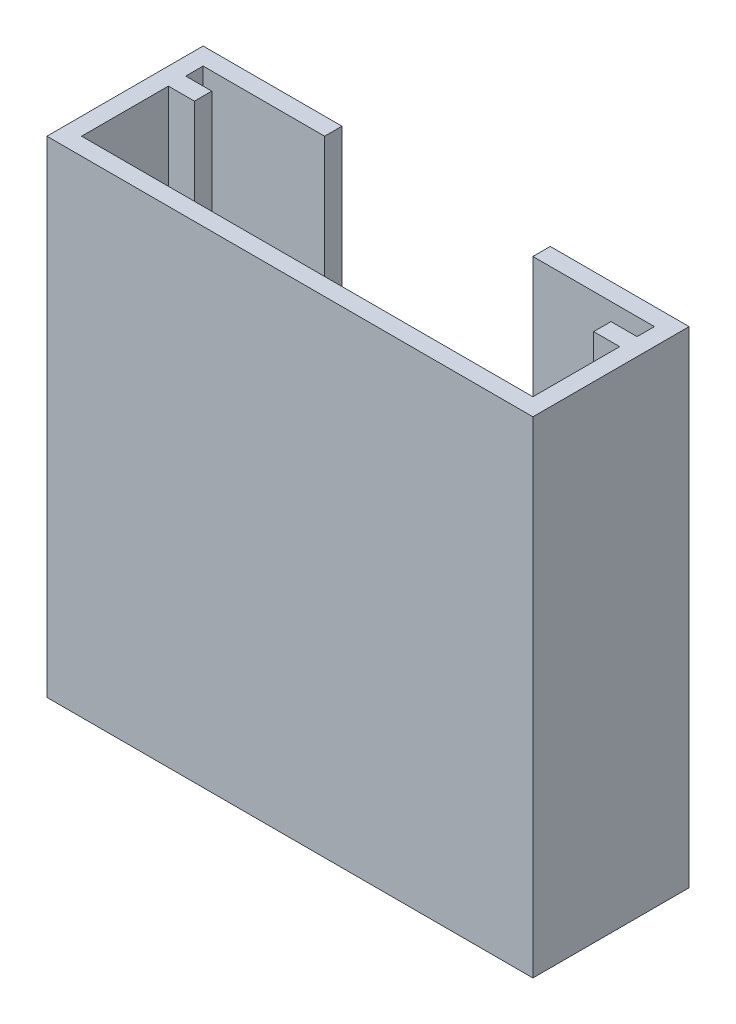
ISO-10303-21;
HEADER;
FILE_DESCRIPTION(('STEP AP214'),'2;1');
FILE_NAME('part.step','',(''),(''),'','','');
FILE_SCHEMA(('AUTOMOTIVE_DESIGN { 1 0 10303 214 1 1 1 1 }'));
ENDSEC;
DATA;
#1=APPLICATION_CONTEXT('core data for automotive mechanical design processes');
#2=APPLICATION_PROTOCOL_DEFINITION('international standard','automotive_design',2000,#1);
#3=PRODUCT_CONTEXT('',#1,'mechanical');
#4=PRODUCT('Part','Part','',(#3));
#5=PRODUCT_RELATED_PRODUCT_CATEGORY('part','',(#4));
#6=PRODUCT_DEFINITION_FORMATION('','',#4);
#7=PRODUCT_DEFINITION_CONTEXT('part definition',#1,'design');
#8=PRODUCT_DEFINITION('design','',#6,#7);
#9=PRODUCT_DEFINITION_SHAPE('','',#8);
#10=(LENGTH_UNIT() NAMED_UNIT(*) SI_UNIT(.MILLI.,.METRE.));
#11=(NAMED_UNIT(*) PLANE_ANGLE_UNIT() SI_UNIT($,.RADIAN.));
#12=(NAMED_UNIT(*) SI_UNIT($,.STERADIAN.) SOLID_ANGLE_UNIT());
#13=UNCERTAINTY_MEASURE_WITH_UNIT(LENGTH_MEASURE(1.E-05),#10,'distance_accuracy_value','');
#14=(GEOMETRIC_REPRESENTATION_CONTEXT(3) GLOBAL_UNCERTAINTY_ASSIGNED_CONTEXT((#13)) GLOBAL_UNIT_ASSIGNED_CONTEXT((#10,
#11,#12)) REPRESENTATION_CONTEXT('',''));
#15=CARTESIAN_POINT('',(0.,0.,0.));
#16=DIRECTION('',(0.,0.,1.));
#17=DIRECTION('',(1.,0.,0.));
#18=AXIS2_PLACEMENT_3D('',#15,#16,#17);
#19=CARTESIAN_POINT('',(0.,-27.,8.));
#20=DIRECTION('',(0.,1.,0.));
#21=DIRECTION('',(0.,0.,1.));
#22=AXIS2_PLACEMENT_3D('',#19,#20,#21);
#23=PLANE('',#22);
#24=DIRECTION('',(0.,0.,1.));
#25=VECTOR('',#24,1.);
#26=CARTESIAN_POINT('',(25.5,-27.,2.));
#27=LINE('',#26,#25);
#28=CARTESIAN_POINT('',(25.5,-27.,2.));
#29=VERTEX_POINT('',#28);
#30=CARTESIAN_POINT('',(25.5,-27.,3.));
#31=VERTEX_POINT('',#30);
#32=EDGE_CURVE('E54',#29,#31,#27,.T.);
#33=ORIENTED_EDGE('',*,*,#32,.F.);
#34=DIRECTION('',(1.,0.,0.));
#35=VECTOR('',#34,1.);
#36=CARTESIAN_POINT('',(25.5,-27.,2.));
#37=LINE('',#36,#35);
#38=CARTESIAN_POINT('',(27.,-27.,2.));
#39=VERTEX_POINT('',#38);
#40=EDGE_CURVE('E224',#29,#39,#37,.T.);
#41=ORIENTED_EDGE('',*,*,#40,.T.);
#42=DIRECTION('',(0.,0.,-1.));
#43=VECTOR('',#42,1.);
#44=CARTESIAN_POINT('',(27.,-27.,8.));
#45=LINE('',#44,#43);
#46=CARTESIAN_POINT('',(27.,-27.,1.));
#47=VERTEX_POINT('',#46);
#48=EDGE_CURVE('E274',#39,#47,#45,.T.);
#49=ORIENTED_EDGE('',*,*,#48,.T.);
#50=DIRECTION('',(1.,0.,0.));
#51=VECTOR('',#50,1.);
#52=CARTESIAN_POINT('',(0.,-27.,1.));
#53=LINE('',#52,#51);
#54=CARTESIAN_POINT('',(1.,-27.,1.));
#55=VERTEX_POINT('',#54);
#56=EDGE_CURVE('E262',#55,#47,#53,.T.);
#57=ORIENTED_EDGE('',*,*,#56,.F.);
#58=DIRECTION('',(0.,0.,-1.));
#59=VECTOR('',#58,1.);
#60=CARTESIAN_POINT('',(1.,-27.,8.));
#61=LINE('',#60,#59);
#62=CARTESIAN_POINT('',(1.,-27.,2.));
#63=VERTEX_POINT('',#62);
#64=EDGE_CURVE('E270',#63,#55,#61,.T.);
#65=ORIENTED_EDGE('',*,*,#64,.F.);
#66=DIRECTION('',(-1.,0.,0.));
#67=VECTOR('',#66,1.);
#68=CARTESIAN_POINT('',(2.5,-27.,2.));
#69=LINE('',#68,#67);
#70=CARTESIAN_POINT('',(2.5,-27.,2.));
#71=VERTEX_POINT('',#70);
#72=EDGE_CURVE('E237',#71,#63,#69,.T.);
#73=ORIENTED_EDGE('',*,*,#72,.F.);
#74=DIRECTION('',(0.,0.,-1.));
#75=VECTOR('',#74,1.);
#76=CARTESIAN_POINT('',(2.5,-27.,2.));
#77=LINE('',#76,#75);
#78=CARTESIAN_POINT('',(2.5,-27.,3.));
#79=VERTEX_POINT('',#78);
#80=EDGE_CURVE('E235',#79,#71,#77,.T.);
#81=ORIENTED_EDGE('',*,*,#80,.F.);
#82=DIRECTION('',(-1.,0.,0.));
#83=VECTOR('',#82,1.);
#84=CARTESIAN_POINT('',(2.5,-27.,3.));
#85=LINE('',#84,#83);
#86=CARTESIAN_POINT('',(1.,-27.,3.));
#87=VERTEX_POINT('',#86);
#88=EDGE_CURVE('E242',#79,#87,#85,.T.);
#89=ORIENTED_EDGE('',*,*,#88,.T.);
#90=CARTESIAN_POINT('',(1.,-27.,8.));
#91=VERTEX_POINT('',#90);
#92=EDGE_CURVE('E271',#91,#87,#61,.T.);
#93=ORIENTED_EDGE('',*,*,#92,.F.);
#94=DIRECTION('',(1.,0.,0.));
#95=VECTOR('',#94,1.);
#96=CARTESIAN_POINT('',(0.,-27.,8.));
#97=LINE('',#96,#95);
#98=CARTESIAN_POINT('',(27.,-27.,8.));
#99=VERTEX_POINT('',#98);
#100=EDGE_CURVE('E252',#91,#99,#97,.T.);
#101=ORIENTED_EDGE('',*,*,#100,.T.);
#102=CARTESIAN_POINT('',(27.,-27.,3.));
#103=VERTEX_POINT('',#102);
#104=EDGE_CURVE('E275',#99,#103,#45,.T.);
#105=ORIENTED_EDGE('',*,*,#104,.T.);
#106=DIRECTION('',(1.,0.,0.));
#107=VECTOR('',#106,1.);
#108=CARTESIAN_POINT('',(25.5,-27.,3.));
#109=LINE('',#108,#107);
#110=EDGE_CURVE('E50',#31,#103,#109,.T.);
#111=ORIENTED_EDGE('',*,*,#110,.F.);
#112=EDGE_LOOP('',(#33,#41,#49,#57,#65,#73,#81,#89,#93,#101,#105,#111));
#113=FACE_BOUND('',#112,.T.);
#114=ADVANCED_FACE('F35',(#113),#23,.T.);
#115=CARTESIAN_POINT('',(27.,0.,8.));
#116=DIRECTION('',(1.,0.,0.));
#117=DIRECTION('',(0.,1.,0.));
#118=AXIS2_PLACEMENT_3D('',#115,#116,#117);
#119=PLANE('',#118);
#120=DIRECTION('',(0.,-1.,0.));
#121=VECTOR('',#120,1.);
#122=CARTESIAN_POINT('',(27.,0.,2.));
#123=LINE('',#122,#121);
#124=CARTESIAN_POINT('',(27.,0.,2.));
#125=VERTEX_POINT('',#124);
#126=EDGE_CURVE('E203',#125,#39,#123,.T.);
#127=ORIENTED_EDGE('',*,*,#126,.F.);
#128=DIRECTION('',(0.,0.,-1.));
#129=VECTOR('',#128,1.);
#130=CARTESIAN_POINT('',(27.,0.,8.));
#131=LINE('',#130,#129);
#132=CARTESIAN_POINT('',(27.,0.,1.));
#133=VERTEX_POINT('',#132);
#134=EDGE_CURVE('E277',#125,#133,#131,.T.);
#135=ORIENTED_EDGE('',*,*,#134,.T.);
#136=DIRECTION('',(0.,-1.,0.));
#137=VECTOR('',#136,1.);
#138=CARTESIAN_POINT('',(27.,0.,1.));
#139=LINE('',#138,#137);
#140=EDGE_CURVE('E249',#133,#47,#139,.T.);
#141=ORIENTED_EDGE('',*,*,#140,.T.);
#142=ORIENTED_EDGE('',*,*,#48,.F.);
#143=EDGE_LOOP('',(#127,#135,#141,#142));
#144=FACE_BOUND('',#143,.T.);
#145=ADVANCED_FACE('F344',(#144),#119,.F.);
#146=DIRECTION('',(0.,1.,0.));
#147=VECTOR('',#146,1.);
#148=CARTESIAN_POINT('',(27.,0.,3.));
#149=LINE('',#148,#147);
#150=CARTESIAN_POINT('',(27.,0.,3.));
#151=VERTEX_POINT('',#150);
#152=EDGE_CURVE('E207',#103,#151,#149,.T.);
#153=ORIENTED_EDGE('',*,*,#152,.F.);
#154=ORIENTED_EDGE('',*,*,#104,.F.);
#155=DIRECTION('',(0.,-1.,0.));
#156=VECTOR('',#155,1.);
#157=CARTESIAN_POINT('',(27.,0.,8.));
#158=LINE('',#157,#156);
#159=CARTESIAN_POINT('',(27.,0.,8.));
#160=VERTEX_POINT('',#159);
#161=EDGE_CURVE('E250',#160,#99,#158,.T.);
#162=ORIENTED_EDGE('',*,*,#161,.F.);
#163=EDGE_CURVE('E278',#160,#151,#131,.T.);
#164=ORIENTED_EDGE('',*,*,#163,.T.);
#165=EDGE_LOOP('',(#153,#154,#162,#164));
#166=FACE_BOUND('',#165,.T.);
#167=ADVANCED_FACE('F357',(#166),#119,.F.);
#168=CARTESIAN_POINT('',(1.,0.,8.));
#169=DIRECTION('',(1.,0.,0.));
#170=DIRECTION('',(0.,1.,0.));
#171=AXIS2_PLACEMENT_3D('',#168,#169,#170);
#172=PLANE('',#171);
#173=DIRECTION('',(0.,0.,-1.));
#174=VECTOR('',#173,1.);
#175=CARTESIAN_POINT('',(1.,0.,8.));
#176=LINE('',#175,#174);
#177=CARTESIAN_POINT('',(1.,0.,2.));
#178=VERTEX_POINT('',#177);
#179=CARTESIAN_POINT('',(1.,0.,1.));
#180=VERTEX_POINT('',#179);
#181=EDGE_CURVE('E259',#178,#180,#176,.T.);
#182=ORIENTED_EDGE('',*,*,#181,.F.);
#183=DIRECTION('',(0.,1.,0.));
#184=VECTOR('',#183,1.);
#185=CARTESIAN_POINT('',(1.,0.,2.));
#186=LINE('',#185,#184);
#187=EDGE_CURVE('E226',#63,#178,#186,.T.);
#188=ORIENTED_EDGE('',*,*,#187,.F.);
#189=ORIENTED_EDGE('',*,*,#64,.T.);
#190=DIRECTION('',(0.,-1.,0.));
#191=VECTOR('',#190,1.);
#192=CARTESIAN_POINT('',(1.,0.,1.));
#193=LINE('',#192,#191);
#194=EDGE_CURVE('E253',#180,#55,#193,.T.);
#195=ORIENTED_EDGE('',*,*,#194,.F.);
#196=EDGE_LOOP('',(#182,#188,#189,#195));
#197=FACE_BOUND('',#196,.T.);
#198=ADVANCED_FACE('F388',(#197),#172,.T.);
#199=ORIENTED_EDGE('',*,*,#92,.T.);
#200=DIRECTION('',(0.,-1.,0.));
#201=VECTOR('',#200,1.);
#202=CARTESIAN_POINT('',(1.,0.,3.));
#203=LINE('',#202,#201);
#204=CARTESIAN_POINT('',(1.,0.,3.));
#205=VERTEX_POINT('',#204);
#206=EDGE_CURVE('E231',#205,#87,#203,.T.);
#207=ORIENTED_EDGE('',*,*,#206,.F.);
#208=CARTESIAN_POINT('',(1.,0.,8.));
#209=VERTEX_POINT('',#208);
#210=EDGE_CURVE('E267',#209,#205,#176,.T.);
#211=ORIENTED_EDGE('',*,*,#210,.F.);
#212=DIRECTION('',(0.,-1.,0.));
#213=VECTOR('',#212,1.);
#214=CARTESIAN_POINT('',(1.,0.,8.));
#215=LINE('',#214,#213);
#216=EDGE_CURVE('E256',#209,#91,#215,.T.);
#217=ORIENTED_EDGE('',*,*,#216,.T.);
#218=EDGE_LOOP('',(#199,#207,#211,#217));
#219=FACE_BOUND('',#218,.T.);
#220=ADVANCED_FACE('F366',(#219),#172,.T.);
#221=CARTESIAN_POINT('',(0.,0.,1.));
#222=DIRECTION('',(0.,0.,1.));
#223=DIRECTION('',(1.,0.,0.));
#224=AXIS2_PLACEMENT_3D('',#221,#222,#223);
#225=PLANE('',#224);
#226=DIRECTION('',(-1.,0.,0.));
#227=VECTOR('',#226,1.);
#228=CARTESIAN_POINT('',(8.,0.,1.));
#229=LINE('',#228,#227);
#230=CARTESIAN_POINT('',(8.,0.,1.));
#231=VERTEX_POINT('',#230);
#232=EDGE_CURVE('E281',#231,#180,#229,.T.);
#233=ORIENTED_EDGE('',*,*,#232,.T.);
#234=ORIENTED_EDGE('',*,*,#194,.T.);
#235=ORIENTED_EDGE('',*,*,#56,.T.);
#236=ORIENTED_EDGE('',*,*,#140,.F.);
#237=DIRECTION('',(-1.,0.,0.));
#238=VECTOR('',#237,1.);
#239=CARTESIAN_POINT('',(20.,0.,1.));
#240=LINE('',#239,#238);
#241=CARTESIAN_POINT('',(20.,0.,1.));
#242=VERTEX_POINT('',#241);
#243=EDGE_CURVE('E284',#133,#242,#240,.T.);
#244=ORIENTED_EDGE('',*,*,#243,.T.);
#245=DIRECTION('',(0.,-1.,0.));
#246=VECTOR('',#245,1.);
#247=CARTESIAN_POINT('',(20.,0.,1.));
#248=LINE('',#247,#246);
#249=CARTESIAN_POINT('',(20.,-23.,1.));
#250=VERTEX_POINT('',#249);
#251=EDGE_CURVE('E287',#242,#250,#248,.T.);
#252=ORIENTED_EDGE('',*,*,#251,.T.);
#253=DIRECTION('',(-1.,0.,0.));
#254=VECTOR('',#253,1.);
#255=CARTESIAN_POINT('',(8.00000000000001,-23.,1.));
#256=LINE('',#255,#254);
#257=CARTESIAN_POINT('',(8.00000000000001,-23.,1.));
#258=VERTEX_POINT('',#257);
#259=EDGE_CURVE('E289',#250,#258,#256,.T.);
#260=ORIENTED_EDGE('',*,*,#259,.T.);
#261=DIRECTION('',(0.,1.,0.));
#262=VECTOR('',#261,1.);
#263=CARTESIAN_POINT('',(8.,0.,1.));
#264=LINE('',#263,#262);
#265=EDGE_CURVE('E291',#258,#231,#264,.T.);
#266=ORIENTED_EDGE('',*,*,#265,.T.);
#267=EDGE_LOOP('',(#233,#234,#235,#236,#244,#252,#260,#266));
#268=FACE_BOUND('',#267,.T.);
#269=ADVANCED_FACE('F335',(#268),#225,.T.);
#270=CARTESIAN_POINT('',(0.,0.,1.));
#271=DIRECTION('',(1.,0.,0.));
#272=DIRECTION('',(0.,1.,0.));
#273=AXIS2_PLACEMENT_3D('',#270,#271,#272);
#274=PLANE('',#273);
#275=DIRECTION('',(0.,-1.,0.));
#276=VECTOR('',#275,1.);
#277=CARTESIAN_POINT('',(0.,0.,0.));
#278=LINE('',#277,#276);
#279=CARTESIAN_POINT('',(0.,0.,0.));
#280=VERTEX_POINT('',#279);
#281=CARTESIAN_POINT('',(0.,-28.,0.));
#282=VERTEX_POINT('',#281);
#283=EDGE_CURVE('E295',#280,#282,#278,.T.);
#284=ORIENTED_EDGE('',*,*,#283,.T.);
#285=DIRECTION('',(0.,0.,-1.));
#286=VECTOR('',#285,1.);
#287=CARTESIAN_POINT('',(0.,-28.,1.));
#288=LINE('',#287,#286);
#289=CARTESIAN_POINT('',(0.,-28.,9.));
#290=VERTEX_POINT('',#289);
#291=EDGE_CURVE('E43',#290,#282,#288,.T.);
#292=ORIENTED_EDGE('',*,*,#291,.F.);
#293=DIRECTION('',(0.,-1.,0.));
#294=VECTOR('',#293,1.);
#295=CARTESIAN_POINT('',(0.,-28.,9.));
#296=LINE('',#295,#294);
#297=CARTESIAN_POINT('',(0.,0.,9.));
#298=VERTEX_POINT('',#297);
#299=EDGE_CURVE('E191',#298,#290,#296,.T.);
#300=ORIENTED_EDGE('',*,*,#299,.F.);
#301=DIRECTION('',(0.,0.,-1.));
#302=VECTOR('',#301,1.);
#303=CARTESIAN_POINT('',(0.,0.,1.));
#304=LINE('',#303,#302);
#305=EDGE_CURVE('E11',#298,#280,#304,.T.);
#306=ORIENTED_EDGE('',*,*,#305,.T.);
#307=EDGE_LOOP('',(#284,#292,#300,#306));
#308=FACE_BOUND('',#307,.T.);
#309=ADVANCED_FACE('F37',(#308),#274,.F.);
#310=CARTESIAN_POINT('',(0.,-28.,1.));
#311=DIRECTION('',(0.,1.,0.));
#312=DIRECTION('',(0.,0.,1.));
#313=AXIS2_PLACEMENT_3D('',#310,#311,#312);
#314=PLANE('',#313);
#315=DIRECTION('',(1.,0.,0.));
#316=VECTOR('',#315,1.);
#317=CARTESIAN_POINT('',(0.,-28.,0.));
#318=LINE('',#317,#316);
#319=CARTESIAN_POINT('',(28.,-28.,0.));
#320=VERTEX_POINT('',#319);
#321=EDGE_CURVE('E297',#282,#320,#318,.T.);
#322=ORIENTED_EDGE('',*,*,#321,.T.);
#323=DIRECTION('',(0.,0.,-1.));
#324=VECTOR('',#323,1.);
#325=CARTESIAN_POINT('',(28.,-28.,1.));
#326=LINE('',#325,#324);
#327=CARTESIAN_POINT('',(28.,-28.,9.));
#328=VERTEX_POINT('',#327);
#329=EDGE_CURVE('E181',#328,#320,#326,.T.);
#330=ORIENTED_EDGE('',*,*,#329,.F.);
#331=DIRECTION('',(1.,0.,0.));
#332=VECTOR('',#331,1.);
#333=CARTESIAN_POINT('',(28.,-28.,9.));
#334=LINE('',#333,#332);
#335=EDGE_CURVE('E196',#290,#328,#334,.T.);
#336=ORIENTED_EDGE('',*,*,#335,.F.);
#337=ORIENTED_EDGE('',*,*,#291,.T.);
#338=EDGE_LOOP('',(#322,#330,#336,#337));
#339=FACE_BOUND('',#338,.T.);
#340=ADVANCED_FACE('F320',(#339),#314,.F.);
#341=CARTESIAN_POINT('',(28.,0.,1.));
#342=DIRECTION('',(-1.,0.,0.));
#343=DIRECTION('',(0.,-1.,0.));
#344=AXIS2_PLACEMENT_3D('',#341,#342,#343);
#345=PLANE('',#344);
#346=DIRECTION('',(0.,1.,0.));
#347=VECTOR('',#346,1.);
#348=CARTESIAN_POINT('',(28.,0.,0.));
#349=LINE('',#348,#347);
#350=CARTESIAN_POINT('',(28.,0.,0.));
#351=VERTEX_POINT('',#350);
#352=EDGE_CURVE('E178',#320,#351,#349,.T.);
#353=ORIENTED_EDGE('',*,*,#352,.T.);
#354=DIRECTION('',(0.,0.,-1.));
#355=VECTOR('',#354,1.);
#356=CARTESIAN_POINT('',(28.,0.,1.));
#357=LINE('',#356,#355);
#358=CARTESIAN_POINT('',(28.,0.,9.));
#359=VERTEX_POINT('',#358);
#360=EDGE_CURVE('E171',#359,#351,#357,.T.);
#361=ORIENTED_EDGE('',*,*,#360,.F.);
#362=DIRECTION('',(0.,1.,0.));
#363=VECTOR('',#362,1.);
#364=CARTESIAN_POINT('',(28.,-28.,9.));
#365=LINE('',#364,#363);
#366=EDGE_CURVE('E176',#328,#359,#365,.T.);
#367=ORIENTED_EDGE('',*,*,#366,.F.);
#368=ORIENTED_EDGE('',*,*,#329,.T.);
#369=EDGE_LOOP('',(#353,#361,#367,#368));
#370=FACE_BOUND('',#369,.T.);
#371=ADVANCED_FACE('F173',(#370),#345,.F.);
#372=CARTESIAN_POINT('',(20.,0.,1.));
#373=DIRECTION('',(0.,-1.,0.));
#374=DIRECTION('',(0.,0.,-1.));
#375=AXIS2_PLACEMENT_3D('',#372,#373,#374);
#376=PLANE('',#375);
#377=DIRECTION('',(-1.,0.,0.));
#378=VECTOR('',#377,1.);
#379=CARTESIAN_POINT('',(20.,0.,0.));
#380=LINE('',#379,#378);
#381=CARTESIAN_POINT('',(20.,0.,0.));
#382=VERTEX_POINT('',#381);
#383=EDGE_CURVE('E300',#351,#382,#380,.T.);
#384=ORIENTED_EDGE('',*,*,#383,.T.);
#385=DIRECTION('',(0.,0.,-1.));
#386=VECTOR('',#385,1.);
#387=CARTESIAN_POINT('',(20.,0.,1.));
#388=LINE('',#387,#386);
#389=EDGE_CURVE('E182',#242,#382,#388,.T.);
#390=ORIENTED_EDGE('',*,*,#389,.F.);
#391=ORIENTED_EDGE('',*,*,#243,.F.);
#392=ORIENTED_EDGE('',*,*,#134,.F.);
#393=DIRECTION('',(1.,0.,0.));
#394=VECTOR('',#393,1.);
#395=CARTESIAN_POINT('',(25.5,0.,2.));
#396=LINE('',#395,#394);
#397=CARTESIAN_POINT('',(25.5,0.,2.));
#398=VERTEX_POINT('',#397);
#399=EDGE_CURVE('E213',#398,#125,#396,.T.);
#400=ORIENTED_EDGE('',*,*,#399,.F.);
#401=DIRECTION('',(0.,0.,-1.));
#402=VECTOR('',#401,1.);
#403=CARTESIAN_POINT('',(25.5,0.,2.));
#404=LINE('',#403,#402);
#405=CARTESIAN_POINT('',(25.5,0.,3.));
#406=VERTEX_POINT('',#405);
#407=EDGE_CURVE('E211',#406,#398,#404,.T.);
#408=ORIENTED_EDGE('',*,*,#407,.F.);
#409=DIRECTION('',(1.,0.,0.));
#410=VECTOR('',#409,1.);
#411=CARTESIAN_POINT('',(25.5,0.,3.));
#412=LINE('',#411,#410);
#413=EDGE_CURVE('E220',#406,#151,#412,.T.);
#414=ORIENTED_EDGE('',*,*,#413,.T.);
#415=ORIENTED_EDGE('',*,*,#163,.F.);
#416=DIRECTION('',(-1.,0.,0.));
#417=VECTOR('',#416,1.);
#418=CARTESIAN_POINT('',(28.,0.,8.));
#419=LINE('',#418,#417);
#420=EDGE_CURVE('E197',#160,#209,#419,.T.);
#421=ORIENTED_EDGE('',*,*,#420,.T.);
#422=ORIENTED_EDGE('',*,*,#210,.T.);
#423=DIRECTION('',(-1.,0.,0.));
#424=VECTOR('',#423,1.);
#425=CARTESIAN_POINT('',(2.5,0.,3.));
#426=LINE('',#425,#424);
#427=CARTESIAN_POINT('',(2.5,0.,3.));
#428=VERTEX_POINT('',#427);
#429=EDGE_CURVE('E245',#428,#205,#426,.T.);
#430=ORIENTED_EDGE('',*,*,#429,.F.);
#431=DIRECTION('',(0.,0.,1.));
#432=VECTOR('',#431,1.);
#433=CARTESIAN_POINT('',(2.5,0.,2.));
#434=LINE('',#433,#432);
#435=CARTESIAN_POINT('',(2.5,0.,2.));
#436=VERTEX_POINT('',#435);
#437=EDGE_CURVE('E230',#436,#428,#434,.T.);
#438=ORIENTED_EDGE('',*,*,#437,.F.);
#439=DIRECTION('',(-1.,0.,0.));
#440=VECTOR('',#439,1.);
#441=CARTESIAN_POINT('',(2.5,0.,2.));
#442=LINE('',#441,#440);
#443=EDGE_CURVE('E247',#436,#178,#442,.T.);
#444=ORIENTED_EDGE('',*,*,#443,.T.);
#445=ORIENTED_EDGE('',*,*,#181,.T.);
#446=ORIENTED_EDGE('',*,*,#232,.F.);
#447=DIRECTION('',(0.,0.,-1.));
#448=VECTOR('',#447,1.);
#449=CARTESIAN_POINT('',(8.,0.,1.));
#450=LINE('',#449,#448);
#451=CARTESIAN_POINT('',(8.,0.,0.));
#452=VERTEX_POINT('',#451);
#453=EDGE_CURVE('E293',#231,#452,#450,.T.);
#454=ORIENTED_EDGE('',*,*,#453,.T.);
#455=DIRECTION('',(-1.,0.,0.));
#456=VECTOR('',#455,1.);
#457=CARTESIAN_POINT('',(8.,0.,0.));
#458=LINE('',#457,#456);
#459=EDGE_CURVE('E280',#452,#280,#458,.T.);
#460=ORIENTED_EDGE('',*,*,#459,.T.);
#461=ORIENTED_EDGE('',*,*,#305,.F.);
#462=DIRECTION('',(-1.,0.,0.));
#463=VECTOR('',#462,1.);
#464=CARTESIAN_POINT('',(28.,0.,9.));
#465=LINE('',#464,#463);
#466=EDGE_CURVE('E185',#359,#298,#465,.T.);
#467=ORIENTED_EDGE('',*,*,#466,.F.);
#468=ORIENTED_EDGE('',*,*,#360,.T.);
#469=EDGE_LOOP('',(#384,#390,#391,#392,#400,#408,#414,#415,#421,#422,#430,#438,#444,#445,#446,
#454,#460,#461,#467,#468));
#470=FACE_BOUND('',#469,.T.);
#471=ADVANCED_FACE('F186',(#470),#376,.F.);
#472=CARTESIAN_POINT('',(20.,0.,1.));
#473=DIRECTION('',(1.,0.,0.));
#474=DIRECTION('',(0.,1.,0.));
#475=AXIS2_PLACEMENT_3D('',#472,#473,#474);
#476=PLANE('',#475);
#477=DIRECTION('',(0.,-1.,0.));
#478=VECTOR('',#477,1.);
#479=CARTESIAN_POINT('',(20.,0.,0.));
#480=LINE('',#479,#478);
#481=CARTESIAN_POINT('',(20.,-23.,0.));
#482=VERTEX_POINT('',#481);
#483=EDGE_CURVE('E302',#382,#482,#480,.T.);
#484=ORIENTED_EDGE('',*,*,#483,.T.);
#485=DIRECTION('',(0.,0.,-1.));
#486=VECTOR('',#485,1.);
#487=CARTESIAN_POINT('',(20.,-23.,1.));
#488=LINE('',#487,#486);
#489=EDGE_CURVE('E312',#250,#482,#488,.T.);
#490=ORIENTED_EDGE('',*,*,#489,.F.);
#491=ORIENTED_EDGE('',*,*,#251,.F.);
#492=ORIENTED_EDGE('',*,*,#389,.T.);
#493=EDGE_LOOP('',(#484,#490,#491,#492));
#494=FACE_BOUND('',#493,.T.);
#495=ADVANCED_FACE('F331',(#494),#476,.F.);
#496=CARTESIAN_POINT('',(8.00000000000001,-23.,1.));
#497=DIRECTION('',(0.,-1.,0.));
#498=DIRECTION('',(0.,0.,-1.));
#499=AXIS2_PLACEMENT_3D('',#496,#497,#498);
#500=PLANE('',#499);
#501=DIRECTION('',(-1.,0.,0.));
#502=VECTOR('',#501,1.);
#503=CARTESIAN_POINT('',(8.00000000000001,-23.,0.));
#504=LINE('',#503,#502);
#505=CARTESIAN_POINT('',(8.00000000000001,-23.,0.));
#506=VERTEX_POINT('',#505);
#507=EDGE_CURVE('E304',#482,#506,#504,.T.);
#508=ORIENTED_EDGE('',*,*,#507,.T.);
#509=DIRECTION('',(0.,0.,-1.));
#510=VECTOR('',#509,1.);
#511=CARTESIAN_POINT('',(8.00000000000001,-23.,1.));
#512=LINE('',#511,#510);
#513=EDGE_CURVE('E309',#258,#506,#512,.T.);
#514=ORIENTED_EDGE('',*,*,#513,.F.);
#515=ORIENTED_EDGE('',*,*,#259,.F.);
#516=ORIENTED_EDGE('',*,*,#489,.T.);
#517=EDGE_LOOP('',(#508,#514,#515,#516));
#518=FACE_BOUND('',#517,.T.);
#519=ADVANCED_FACE('F410',(#518),#500,.F.);
#520=CARTESIAN_POINT('',(8.,0.,1.));
#521=DIRECTION('',(-1.,0.,0.));
#522=DIRECTION('',(0.,-1.,0.));
#523=AXIS2_PLACEMENT_3D('',#520,#521,#522);
#524=PLANE('',#523);
#525=DIRECTION('',(0.,1.,0.));
#526=VECTOR('',#525,1.);
#527=CARTESIAN_POINT('',(8.,0.,0.));
#528=LINE('',#527,#526);
#529=EDGE_CURVE('E285',#506,#452,#528,.T.);
#530=ORIENTED_EDGE('',*,*,#529,.T.);
#531=ORIENTED_EDGE('',*,*,#453,.F.);
#532=ORIENTED_EDGE('',*,*,#265,.F.);
#533=ORIENTED_EDGE('',*,*,#513,.T.);
#534=EDGE_LOOP('',(#530,#531,#532,#533));
#535=FACE_BOUND('',#534,.T.);
#536=ADVANCED_FACE('F407',(#535),#524,.F.);
#537=CARTESIAN_POINT('',(0.,0.,0.));
#538=DIRECTION('',(0.,0.,1.));
#539=DIRECTION('',(1.,0.,0.));
#540=AXIS2_PLACEMENT_3D('',#537,#538,#539);
#541=PLANE('',#540);
#542=ORIENTED_EDGE('',*,*,#459,.F.);
#543=ORIENTED_EDGE('',*,*,#529,.F.);
#544=ORIENTED_EDGE('',*,*,#507,.F.);
#545=ORIENTED_EDGE('',*,*,#483,.F.);
#546=ORIENTED_EDGE('',*,*,#383,.F.);
#547=ORIENTED_EDGE('',*,*,#352,.F.);
#548=ORIENTED_EDGE('',*,*,#321,.F.);
#549=ORIENTED_EDGE('',*,*,#283,.F.);
#550=EDGE_LOOP('',(#542,#543,#544,#545,#546,#547,#548,#549));
#551=FACE_BOUND('',#550,.T.);
#552=ADVANCED_FACE('F324',(#551),#541,.F.);
#553=CARTESIAN_POINT('',(2.5,0.,2.));
#554=DIRECTION('',(0.,0.,1.));
#555=DIRECTION('',(0.,-1.,0.));
#556=AXIS2_PLACEMENT_3D('',#553,#554,#555);
#557=PLANE('',#556);
#558=ORIENTED_EDGE('',*,*,#187,.T.);
#559=ORIENTED_EDGE('',*,*,#443,.F.);
#560=DIRECTION('',(0.,1.,0.));
#561=VECTOR('',#560,1.);
#562=CARTESIAN_POINT('',(2.5,0.,2.));
#563=LINE('',#562,#561);
#564=EDGE_CURVE('E227',#71,#436,#563,.T.);
#565=ORIENTED_EDGE('',*,*,#564,.F.);
#566=ORIENTED_EDGE('',*,*,#72,.T.);
#567=EDGE_LOOP('',(#558,#559,#565,#566));
#568=FACE_BOUND('',#567,.T.);
#569=ADVANCED_FACE('F379',(#568),#557,.F.);
#570=CARTESIAN_POINT('',(2.5,0.,3.));
#571=DIRECTION('',(0.,0.,-1.));
#572=DIRECTION('',(0.,1.,0.));
#573=AXIS2_PLACEMENT_3D('',#570,#571,#572);
#574=PLANE('',#573);
#575=ORIENTED_EDGE('',*,*,#206,.T.);
#576=ORIENTED_EDGE('',*,*,#88,.F.);
#577=DIRECTION('',(0.,-1.,0.));
#578=VECTOR('',#577,1.);
#579=CARTESIAN_POINT('',(2.5,0.,3.));
#580=LINE('',#579,#578);
#581=EDGE_CURVE('E233',#428,#79,#580,.T.);
#582=ORIENTED_EDGE('',*,*,#581,.F.);
#583=ORIENTED_EDGE('',*,*,#429,.T.);
#584=EDGE_LOOP('',(#575,#576,#582,#583));
#585=FACE_BOUND('',#584,.T.);
#586=ADVANCED_FACE('F369',(#585),#574,.F.);
#587=CARTESIAN_POINT('',(2.5,0.,0.));
#588=DIRECTION('',(-1.,0.,0.));
#589=DIRECTION('',(0.,-1.,0.));
#590=AXIS2_PLACEMENT_3D('',#587,#588,#589);
#591=PLANE('',#590);
#592=ORIENTED_EDGE('',*,*,#564,.T.);
#593=ORIENTED_EDGE('',*,*,#437,.T.);
#594=ORIENTED_EDGE('',*,*,#581,.T.);
#595=ORIENTED_EDGE('',*,*,#80,.T.);
#596=EDGE_LOOP('',(#592,#593,#594,#595));
#597=FACE_BOUND('',#596,.T.);
#598=ADVANCED_FACE('F376',(#597),#591,.F.);
#599=CARTESIAN_POINT('',(25.5,0.,2.));
#600=DIRECTION('',(0.,0.,1.));
#601=DIRECTION('',(0.,-1.,0.));
#602=AXIS2_PLACEMENT_3D('',#599,#600,#601);
#603=PLANE('',#602);
#604=ORIENTED_EDGE('',*,*,#126,.T.);
#605=ORIENTED_EDGE('',*,*,#40,.F.);
#606=DIRECTION('',(0.,-1.,0.));
#607=VECTOR('',#606,1.);
#608=CARTESIAN_POINT('',(25.5,0.,2.));
#609=LINE('',#608,#607);
#610=EDGE_CURVE('E205',#398,#29,#609,.T.);
#611=ORIENTED_EDGE('',*,*,#610,.F.);
#612=ORIENTED_EDGE('',*,*,#399,.T.);
#613=EDGE_LOOP('',(#604,#605,#611,#612));
#614=FACE_BOUND('',#613,.T.);
#615=ADVANCED_FACE('F347',(#614),#603,.F.);
#616=CARTESIAN_POINT('',(25.5,0.,3.));
#617=DIRECTION('',(0.,0.,-1.));
#618=DIRECTION('',(0.,1.,0.));
#619=AXIS2_PLACEMENT_3D('',#616,#617,#618);
#620=PLANE('',#619);
#621=ORIENTED_EDGE('',*,*,#152,.T.);
#622=ORIENTED_EDGE('',*,*,#413,.F.);
#623=DIRECTION('',(0.,1.,0.));
#624=VECTOR('',#623,1.);
#625=CARTESIAN_POINT('',(25.5,0.,3.));
#626=LINE('',#625,#624);
#627=EDGE_CURVE('E209',#31,#406,#626,.T.);
#628=ORIENTED_EDGE('',*,*,#627,.F.);
#629=ORIENTED_EDGE('',*,*,#110,.T.);
#630=EDGE_LOOP('',(#621,#622,#628,#629));
#631=FACE_BOUND('',#630,.T.);
#632=ADVANCED_FACE('F354',(#631),#620,.F.);
#633=CARTESIAN_POINT('',(25.5,0.,0.));
#634=DIRECTION('',(-1.,0.,0.));
#635=DIRECTION('',(0.,-1.,0.));
#636=AXIS2_PLACEMENT_3D('',#633,#634,#635);
#637=PLANE('',#636);
#638=ORIENTED_EDGE('',*,*,#610,.T.);
#639=ORIENTED_EDGE('',*,*,#32,.T.);
#640=ORIENTED_EDGE('',*,*,#627,.T.);
#641=ORIENTED_EDGE('',*,*,#407,.T.);
#642=EDGE_LOOP('',(#638,#639,#640,#641));
#643=FACE_BOUND('',#642,.T.);
#644=ADVANCED_FACE('F349',(#643),#637,.T.);
#645=CARTESIAN_POINT('',(0.,0.,8.));
#646=DIRECTION('',(0.,0.,1.));
#647=DIRECTION('',(1.,0.,0.));
#648=AXIS2_PLACEMENT_3D('',#645,#646,#647);
#649=PLANE('',#648);
#650=ORIENTED_EDGE('',*,*,#420,.F.);
#651=ORIENTED_EDGE('',*,*,#161,.T.);
#652=ORIENTED_EDGE('',*,*,#100,.F.);
#653=ORIENTED_EDGE('',*,*,#216,.F.);
#654=EDGE_LOOP('',(#650,#651,#652,#653));
#655=FACE_BOUND('',#654,.T.);
#656=ADVANCED_FACE('F361',(#655),#649,.F.);
#657=CARTESIAN_POINT('',(0.,0.,9.));
#658=DIRECTION('',(0.,0.,1.));
#659=DIRECTION('',(1.,0.,0.));
#660=AXIS2_PLACEMENT_3D('',#657,#658,#659);
#661=PLANE('',#660);
#662=ORIENTED_EDGE('',*,*,#366,.T.);
#663=ORIENTED_EDGE('',*,*,#466,.T.);
#664=ORIENTED_EDGE('',*,*,#299,.T.);
#665=ORIENTED_EDGE('',*,*,#335,.T.);
#666=EDGE_LOOP('',(#662,#663,#664,#665));
#667=FACE_BOUND('',#666,.T.);
#668=ADVANCED_FACE('F194',(#667),#661,.T.);
#669=CLOSED_SHELL('',(#114,#145,#167,#198,#220,#269,#309,#340,#371,#471,#495,#519,#536,#552,
#569,#586,#598,#615,#632,#644,#656,#668));
#670=MANIFOLD_SOLID_BREP('B2',#669);
#671=ADVANCED_BREP_SHAPE_REPRESENTATION('',(#18,#670),#14);
#672=SHAPE_DEFINITION_REPRESENTATION(#9,#671);
ENDSEC;
END-ISO-10303-21;
